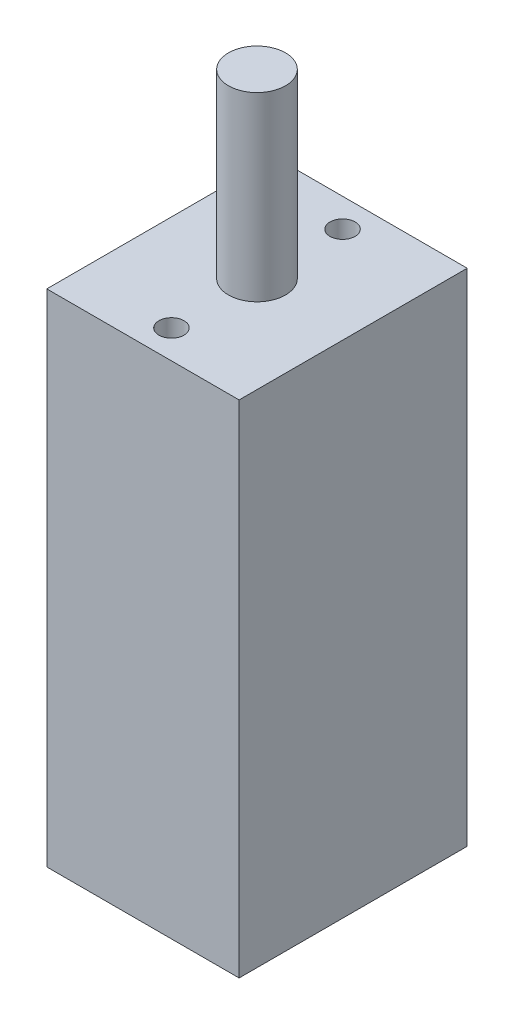
ISO-10303-21;
HEADER;
FILE_DESCRIPTION(('STEP AP214'),'2;1');
FILE_NAME('part.step','',(''),(''),'','','');
FILE_SCHEMA(('AUTOMOTIVE_DESIGN { 1 0 10303 214 1 1 1 1 }'));
ENDSEC;
DATA;
#1=APPLICATION_CONTEXT('core data for automotive mechanical design processes');
#2=APPLICATION_PROTOCOL_DEFINITION('international standard','automotive_design',2000,#1);
#3=PRODUCT_CONTEXT('',#1,'mechanical');
#4=PRODUCT('Part','Part','',(#3));
#5=PRODUCT_RELATED_PRODUCT_CATEGORY('part','',(#4));
#6=PRODUCT_DEFINITION_FORMATION('','',#4);
#7=PRODUCT_DEFINITION_CONTEXT('part definition',#1,'design');
#8=PRODUCT_DEFINITION('design','',#6,#7);
#9=PRODUCT_DEFINITION_SHAPE('','',#8);
#10=(LENGTH_UNIT() NAMED_UNIT(*) SI_UNIT(.MILLI.,.METRE.));
#11=(NAMED_UNIT(*) PLANE_ANGLE_UNIT() SI_UNIT($,.RADIAN.));
#12=(NAMED_UNIT(*) SI_UNIT($,.STERADIAN.) SOLID_ANGLE_UNIT());
#13=UNCERTAINTY_MEASURE_WITH_UNIT(LENGTH_MEASURE(1.E-05),#10,'distance_accuracy_value','');
#14=(GEOMETRIC_REPRESENTATION_CONTEXT(3) GLOBAL_UNCERTAINTY_ASSIGNED_CONTEXT((#13)) GLOBAL_UNIT_ASSIGNED_CONTEXT((#10,
#11,#12)) REPRESENTATION_CONTEXT('',''));
#15=CARTESIAN_POINT('',(0.,0.,0.));
#16=DIRECTION('',(0.,0.,1.));
#17=DIRECTION('',(1.,0.,0.));
#18=AXIS2_PLACEMENT_3D('',#15,#16,#17);
#19=CARTESIAN_POINT('',(-5.0546,0.,5.9944));
#20=DIRECTION('',(0.,1.,0.));
#21=DIRECTION('',(0.,0.,1.));
#22=AXIS2_PLACEMENT_3D('',#19,#20,#21);
#23=PLANE('',#22);
#24=CARTESIAN_POINT('',(0.,0.,-4.4958));
#25=DIRECTION('',(0.,1.,0.));
#26=DIRECTION('',(0.,0.,1.));
#27=AXIS2_PLACEMENT_3D('',#24,#25,#26);
#28=CIRCLE('',#27,0.6604);
#29=CARTESIAN_POINT('',(0.,0.,-3.8354));
#30=VERTEX_POINT('',#29);
#31=EDGE_CURVE('E485',#30,#30,#28,.T.);
#32=ORIENTED_EDGE('',*,*,#31,.F.);
#33=EDGE_LOOP('',(#32));
#34=FACE_BOUND('',#33,.T.);
#35=CARTESIAN_POINT('',(0.,0.,4.4958));
#36=DIRECTION('',(0.,1.,0.));
#37=DIRECTION('',(0.,0.,1.));
#38=AXIS2_PLACEMENT_3D('',#35,#36,#37);
#39=CIRCLE('',#38,0.6604);
#40=CARTESIAN_POINT('',(0.,0.,5.1562));
#41=VERTEX_POINT('',#40);
#42=EDGE_CURVE('E484',#41,#41,#39,.T.);
#43=ORIENTED_EDGE('',*,*,#42,.F.);
#44=EDGE_LOOP('',(#43));
#45=FACE_BOUND('',#44,.T.);
#46=DIRECTION('',(0.,0.,1.));
#47=VECTOR('',#46,1.);
#48=CARTESIAN_POINT('',(-5.0546,0.,-5.9944));
#49=LINE('',#48,#47);
#50=CARTESIAN_POINT('',(-5.0546,0.,-5.9944));
#51=VERTEX_POINT('',#50);
#52=CARTESIAN_POINT('',(-5.0546,0.,5.9944));
#53=VERTEX_POINT('',#52);
#54=EDGE_CURVE('E401',#51,#53,#49,.T.);
#55=ORIENTED_EDGE('',*,*,#54,.T.);
#56=DIRECTION('',(1.,0.,0.));
#57=VECTOR('',#56,1.);
#58=CARTESIAN_POINT('',(-5.0546,0.,5.9944));
#59=LINE('',#58,#57);
#60=CARTESIAN_POINT('',(5.0546,0.,5.9944));
#61=VERTEX_POINT('',#60);
#62=EDGE_CURVE('E410',#53,#61,#59,.T.);
#63=ORIENTED_EDGE('',*,*,#62,.T.);
#64=DIRECTION('',(0.,0.,-1.));
#65=VECTOR('',#64,1.);
#66=CARTESIAN_POINT('',(5.0546,0.,-5.9944));
#67=LINE('',#66,#65);
#68=CARTESIAN_POINT('',(5.0546,0.,-5.9944));
#69=VERTEX_POINT('',#68);
#70=EDGE_CURVE('E415',#61,#69,#67,.T.);
#71=ORIENTED_EDGE('',*,*,#70,.T.);
#72=DIRECTION('',(-1.,0.,0.));
#73=VECTOR('',#72,1.);
#74=CARTESIAN_POINT('',(-5.0546,0.,-5.9944));
#75=LINE('',#74,#73);
#76=EDGE_CURVE('E418',#69,#51,#75,.T.);
#77=ORIENTED_EDGE('',*,*,#76,.T.);
#78=EDGE_LOOP('',(#55,#63,#71,#77));
#79=FACE_BOUND('',#78,.T.);
#80=CARTESIAN_POINT('',(0.,0.,0.));
#81=DIRECTION('',(0.,1.,0.));
#82=DIRECTION('',(0.,0.,1.));
#83=AXIS2_PLACEMENT_3D('',#80,#81,#82);
#84=CIRCLE('',#83,1.5);
#85=CARTESIAN_POINT('',(0.,0.,1.5));
#86=VERTEX_POINT('',#85);
#87=EDGE_CURVE('E422',#86,#86,#84,.T.);
#88=ORIENTED_EDGE('',*,*,#87,.F.);
#89=EDGE_LOOP('',(#88));
#90=FACE_BOUND('',#89,.T.);
#91=ADVANCED_FACE('F360',(#34,#45,#79,#90),#23,.T.);
#92=CARTESIAN_POINT('',(-5.0546,-26.3144,-5.9944));
#93=DIRECTION('',(-1.,0.,0.));
#94=DIRECTION('',(0.,0.,1.));
#95=AXIS2_PLACEMENT_3D('',#92,#93,#94);
#96=PLANE('',#95);
#97=ORIENTED_EDGE('',*,*,#54,.F.);
#98=DIRECTION('',(0.,1.,0.));
#99=VECTOR('',#98,1.);
#100=CARTESIAN_POINT('',(-5.0546,-26.3144,-5.9944));
#101=LINE('',#100,#99);
#102=CARTESIAN_POINT('',(-5.0546,-26.3144,-5.9944));
#103=VERTEX_POINT('',#102);
#104=EDGE_CURVE('E11',#103,#51,#101,.T.);
#105=ORIENTED_EDGE('',*,*,#104,.F.);
#106=DIRECTION('',(0.,0.,1.));
#107=VECTOR('',#106,1.);
#108=CARTESIAN_POINT('',(-5.0546,-26.3144,-5.9944));
#109=LINE('',#108,#107);
#110=CARTESIAN_POINT('',(-5.0546,-26.3144,5.9944));
#111=VERTEX_POINT('',#110);
#112=EDGE_CURVE('E403',#103,#111,#109,.T.);
#113=ORIENTED_EDGE('',*,*,#112,.T.);
#114=DIRECTION('',(0.,1.,0.));
#115=VECTOR('',#114,1.);
#116=CARTESIAN_POINT('',(-5.0546,-26.3144,5.9944));
#117=LINE('',#116,#115);
#118=EDGE_CURVE('E364',#111,#53,#117,.T.);
#119=ORIENTED_EDGE('',*,*,#118,.T.);
#120=EDGE_LOOP('',(#97,#105,#113,#119));
#121=FACE_BOUND('',#120,.T.);
#122=ADVANCED_FACE('F362',(#121),#96,.T.);
#123=CARTESIAN_POINT('',(-5.0546,-26.3144,-5.9944));
#124=DIRECTION('',(0.,0.,-1.));
#125=DIRECTION('',(-1.,0.,0.));
#126=AXIS2_PLACEMENT_3D('',#123,#124,#125);
#127=PLANE('',#126);
#128=ORIENTED_EDGE('',*,*,#76,.F.);
#129=DIRECTION('',(0.,1.,0.));
#130=VECTOR('',#129,1.);
#131=CARTESIAN_POINT('',(5.0546,-26.3144,-5.9944));
#132=LINE('',#131,#130);
#133=CARTESIAN_POINT('',(5.0546,-26.3144,-5.9944));
#134=VERTEX_POINT('',#133);
#135=EDGE_CURVE('E369',#134,#69,#132,.T.);
#136=ORIENTED_EDGE('',*,*,#135,.F.);
#137=DIRECTION('',(-1.,0.,0.));
#138=VECTOR('',#137,1.);
#139=CARTESIAN_POINT('',(-5.0546,-26.3144,-5.9944));
#140=LINE('',#139,#138);
#141=EDGE_CURVE('E408',#134,#103,#140,.T.);
#142=ORIENTED_EDGE('',*,*,#141,.T.);
#143=ORIENTED_EDGE('',*,*,#104,.T.);
#144=EDGE_LOOP('',(#128,#136,#142,#143));
#145=FACE_BOUND('',#144,.T.);
#146=ADVANCED_FACE('F438',(#145),#127,.T.);
#147=CARTESIAN_POINT('',(5.0546,-26.3144,-5.9944));
#148=DIRECTION('',(1.,0.,0.));
#149=DIRECTION('',(0.,0.,-1.));
#150=AXIS2_PLACEMENT_3D('',#147,#148,#149);
#151=PLANE('',#150);
#152=ORIENTED_EDGE('',*,*,#70,.F.);
#153=DIRECTION('',(0.,1.,0.));
#154=VECTOR('',#153,1.);
#155=CARTESIAN_POINT('',(5.0546,-26.3144,5.9944));
#156=LINE('',#155,#154);
#157=CARTESIAN_POINT('',(5.0546,-26.3144,5.9944));
#158=VERTEX_POINT('',#157);
#159=EDGE_CURVE('E407',#158,#61,#156,.T.);
#160=ORIENTED_EDGE('',*,*,#159,.F.);
#161=DIRECTION('',(0.,0.,-1.));
#162=VECTOR('',#161,1.);
#163=CARTESIAN_POINT('',(5.0546,-26.3144,-5.9944));
#164=LINE('',#163,#162);
#165=EDGE_CURVE('E431',#158,#134,#164,.T.);
#166=ORIENTED_EDGE('',*,*,#165,.T.);
#167=ORIENTED_EDGE('',*,*,#135,.T.);
#168=EDGE_LOOP('',(#152,#160,#166,#167));
#169=FACE_BOUND('',#168,.T.);
#170=ADVANCED_FACE('F435',(#169),#151,.T.);
#171=CARTESIAN_POINT('',(-5.0546,-26.3144,5.9944));
#172=DIRECTION('',(0.,0.,1.));
#173=DIRECTION('',(1.,0.,0.));
#174=AXIS2_PLACEMENT_3D('',#171,#172,#173);
#175=PLANE('',#174);
#176=ORIENTED_EDGE('',*,*,#62,.F.);
#177=ORIENTED_EDGE('',*,*,#118,.F.);
#178=DIRECTION('',(1.,0.,0.));
#179=VECTOR('',#178,1.);
#180=CARTESIAN_POINT('',(-5.0546,-26.3144,5.9944));
#181=LINE('',#180,#179);
#182=EDGE_CURVE('E429',#111,#158,#181,.T.);
#183=ORIENTED_EDGE('',*,*,#182,.T.);
#184=ORIENTED_EDGE('',*,*,#159,.T.);
#185=EDGE_LOOP('',(#176,#177,#183,#184));
#186=FACE_BOUND('',#185,.T.);
#187=ADVANCED_FACE('F411',(#186),#175,.T.);
#188=CARTESIAN_POINT('',(-5.0546,-26.3144,5.9944));
#189=DIRECTION('',(0.,1.,0.));
#190=DIRECTION('',(0.,0.,1.));
#191=AXIS2_PLACEMENT_3D('',#188,#189,#190);
#192=PLANE('',#191);
#193=ORIENTED_EDGE('',*,*,#112,.F.);
#194=ORIENTED_EDGE('',*,*,#141,.F.);
#195=ORIENTED_EDGE('',*,*,#165,.F.);
#196=ORIENTED_EDGE('',*,*,#182,.F.);
#197=EDGE_LOOP('',(#193,#194,#195,#196));
#198=FACE_BOUND('',#197,.T.);
#199=ADVANCED_FACE('F440',(#198),#192,.F.);
#200=CARTESIAN_POINT('',(0.,9.525,0.));
#201=DIRECTION('',(0.,-1.,0.));
#202=DIRECTION('',(0.,0.,-1.));
#203=AXIS2_PLACEMENT_3D('',#200,#201,#202);
#204=CYLINDRICAL_SURFACE('',#203,1.5);
#205=CARTESIAN_POINT('',(0.,9.525,0.));
#206=DIRECTION('',(0.,1.,0.));
#207=DIRECTION('',(0.,0.,1.));
#208=AXIS2_PLACEMENT_3D('',#205,#206,#207);
#209=CIRCLE('',#208,1.5);
#210=CARTESIAN_POINT('',(0.,9.525,1.5));
#211=VERTEX_POINT('',#210);
#212=EDGE_CURVE('E419',#211,#211,#209,.T.);
#213=ORIENTED_EDGE('',*,*,#212,.F.);
#214=EDGE_LOOP('',(#213));
#215=FACE_BOUND('',#214,.T.);
#216=ORIENTED_EDGE('',*,*,#87,.T.);
#217=EDGE_LOOP('',(#216));
#218=FACE_BOUND('',#217,.T.);
#219=ADVANCED_FACE('F442',(#215,#218),#204,.T.);
#220=CARTESIAN_POINT('',(0.,9.525,0.));
#221=DIRECTION('',(0.,1.,0.));
#222=DIRECTION('',(0.,0.,1.));
#223=AXIS2_PLACEMENT_3D('',#220,#221,#222);
#224=PLANE('',#223);
#225=ORIENTED_EDGE('',*,*,#212,.T.);
#226=EDGE_LOOP('',(#225));
#227=FACE_BOUND('',#226,.T.);
#228=ADVANCED_FACE('F448',(#227),#224,.T.);
#229=CARTESIAN_POINT('',(0.,-3.175,4.4958));
#230=DIRECTION('',(0.,1.,0.));
#231=DIRECTION('',(0.,0.,1.));
#232=AXIS2_PLACEMENT_3D('',#229,#230,#231);
#233=CYLINDRICAL_SURFACE('',#232,0.6604);
#234=CARTESIAN_POINT('',(0.,-3.175,4.4958));
#235=DIRECTION('',(0.,1.,0.));
#236=DIRECTION('',(0.,0.,1.));
#237=AXIS2_PLACEMENT_3D('',#234,#235,#236);
#238=CIRCLE('',#237,0.6604);
#239=CARTESIAN_POINT('',(0.,-3.175,5.1562));
#240=VERTEX_POINT('',#239);
#241=EDGE_CURVE('E488',#240,#240,#238,.T.);
#242=ORIENTED_EDGE('',*,*,#241,.F.);
#243=EDGE_LOOP('',(#242));
#244=FACE_BOUND('',#243,.T.);
#245=ORIENTED_EDGE('',*,*,#42,.T.);
#246=EDGE_LOOP('',(#245));
#247=FACE_BOUND('',#246,.T.);
#248=ADVANCED_FACE('F464',(#244,#247),#233,.F.);
#249=CARTESIAN_POINT('',(0.,-3.175,4.4958));
#250=DIRECTION('',(0.,1.,0.));
#251=DIRECTION('',(0.,0.,1.));
#252=AXIS2_PLACEMENT_3D('',#249,#250,#251);
#253=PLANE('',#252);
#254=ORIENTED_EDGE('',*,*,#241,.T.);
#255=EDGE_LOOP('',(#254));
#256=FACE_BOUND('',#255,.T.);
#257=ADVANCED_FACE('F467',(#256),#253,.T.);
#258=CARTESIAN_POINT('',(0.,-3.175,-4.4958));
#259=DIRECTION('',(0.,1.,0.));
#260=DIRECTION('',(0.,0.,1.));
#261=AXIS2_PLACEMENT_3D('',#258,#259,#260);
#262=CYLINDRICAL_SURFACE('',#261,0.6604);
#263=CARTESIAN_POINT('',(0.,-3.175,-4.4958));
#264=DIRECTION('',(0.,1.,0.));
#265=DIRECTION('',(0.,0.,1.));
#266=AXIS2_PLACEMENT_3D('',#263,#264,#265);
#267=CIRCLE('',#266,0.6604);
#268=CARTESIAN_POINT('',(0.,-3.175,-3.8354));
#269=VERTEX_POINT('',#268);
#270=EDGE_CURVE('E483',#269,#269,#267,.T.);
#271=ORIENTED_EDGE('',*,*,#270,.F.);
#272=EDGE_LOOP('',(#271));
#273=FACE_BOUND('',#272,.T.);
#274=ORIENTED_EDGE('',*,*,#31,.T.);
#275=EDGE_LOOP('',(#274));
#276=FACE_BOUND('',#275,.T.);
#277=ADVANCED_FACE('F471',(#273,#276),#262,.F.);
#278=CARTESIAN_POINT('',(0.,-3.175,-4.4958));
#279=DIRECTION('',(0.,1.,0.));
#280=DIRECTION('',(0.,0.,1.));
#281=AXIS2_PLACEMENT_3D('',#278,#279,#280);
#282=PLANE('',#281);
#283=ORIENTED_EDGE('',*,*,#270,.T.);
#284=EDGE_LOOP('',(#283));
#285=FACE_BOUND('',#284,.T.);
#286=ADVANCED_FACE('F475',(#285),#282,.T.);
#287=CLOSED_SHELL('',(#91,#122,#146,#170,#187,#199,#219,#228,#248,#257,#277,#286));
#288=MANIFOLD_SOLID_BREP('B2',#287);
#289=ADVANCED_BREP_SHAPE_REPRESENTATION('',(#18,#288),#14);
#290=SHAPE_DEFINITION_REPRESENTATION(#9,#289);
ENDSEC;
END-ISO-10303-21;
